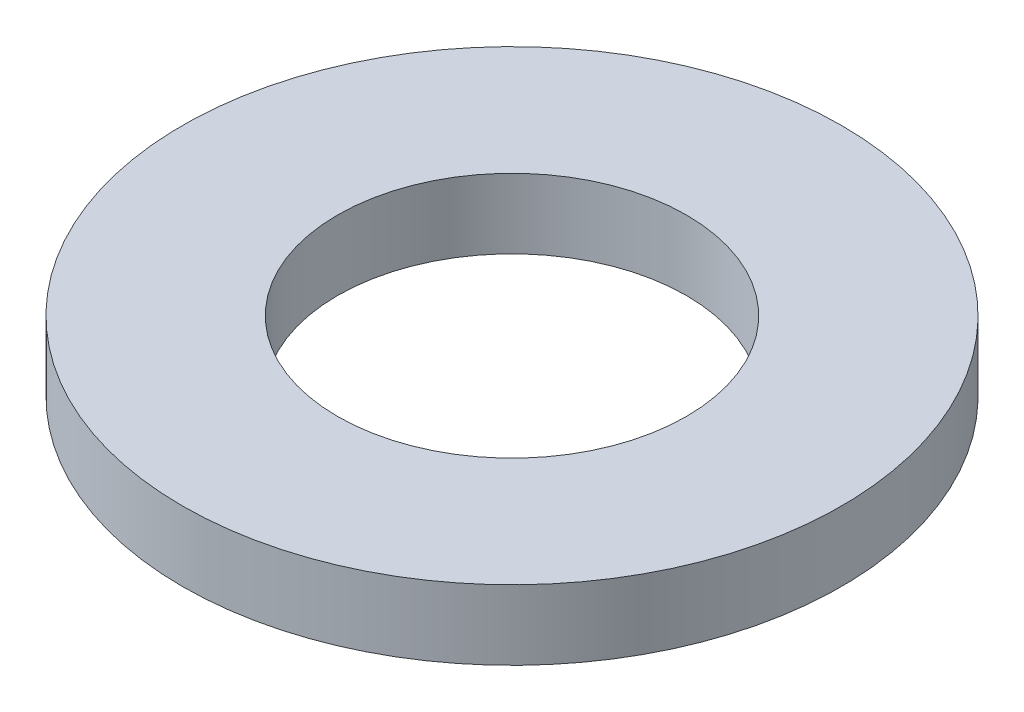
ISO-10303-21;
HEADER;
FILE_DESCRIPTION(('STEP AP214'),'2;1');
FILE_NAME('part.step','',(''),(''),'','','');
FILE_SCHEMA(('AUTOMOTIVE_DESIGN { 1 0 10303 214 1 1 1 1 }'));
ENDSEC;
DATA;
#1=APPLICATION_CONTEXT('core data for automotive mechanical design processes');
#2=APPLICATION_PROTOCOL_DEFINITION('international standard','automotive_design',2000,#1);
#3=PRODUCT_CONTEXT('',#1,'mechanical');
#4=PRODUCT('Part','Part','',(#3));
#5=PRODUCT_RELATED_PRODUCT_CATEGORY('part','',(#4));
#6=PRODUCT_DEFINITION_FORMATION('','',#4);
#7=PRODUCT_DEFINITION_CONTEXT('part definition',#1,'design');
#8=PRODUCT_DEFINITION('design','',#6,#7);
#9=PRODUCT_DEFINITION_SHAPE('','',#8);
#10=(LENGTH_UNIT() NAMED_UNIT(*) SI_UNIT(.MILLI.,.METRE.));
#11=(NAMED_UNIT(*) PLANE_ANGLE_UNIT() SI_UNIT($,.RADIAN.));
#12=(NAMED_UNIT(*) SI_UNIT($,.STERADIAN.) SOLID_ANGLE_UNIT());
#13=UNCERTAINTY_MEASURE_WITH_UNIT(LENGTH_MEASURE(1.E-05),#10,'distance_accuracy_value','');
#14=(GEOMETRIC_REPRESENTATION_CONTEXT(3) GLOBAL_UNCERTAINTY_ASSIGNED_CONTEXT((#13)) GLOBAL_UNIT_ASSIGNED_CONTEXT((#10,
#11,#12)) REPRESENTATION_CONTEXT('',''));
#15=CARTESIAN_POINT('',(0.,0.,0.));
#16=DIRECTION('',(0.,0.,1.));
#17=DIRECTION('',(1.,0.,0.));
#18=AXIS2_PLACEMENT_3D('',#15,#16,#17);
#19=CARTESIAN_POINT('',(0.,18.,0.));
#20=DIRECTION('',(0.,-1.,0.));
#21=DIRECTION('',(0.,0.,-1.));
#22=AXIS2_PLACEMENT_3D('',#19,#20,#21);
#23=CYLINDRICAL_SURFACE('',#22,85.);
#24=CARTESIAN_POINT('',(0.,18.,0.));
#25=DIRECTION('',(0.,1.,0.));
#26=DIRECTION('',(0.,0.,1.));
#27=AXIS2_PLACEMENT_3D('',#24,#25,#26);
#28=CIRCLE('',#27,85.);
#29=CARTESIAN_POINT('',(0.,18.,85.));
#30=VERTEX_POINT('',#29);
#31=EDGE_CURVE('E10',#30,#30,#28,.T.);
#32=ORIENTED_EDGE('',*,*,#31,.F.);
#33=EDGE_LOOP('',(#32));
#34=FACE_BOUND('',#33,.T.);
#35=CARTESIAN_POINT('',(0.,0.,0.));
#36=DIRECTION('',(0.,1.,0.));
#37=DIRECTION('',(0.,0.,1.));
#38=AXIS2_PLACEMENT_3D('',#35,#36,#37);
#39=CIRCLE('',#38,85.);
#40=CARTESIAN_POINT('',(0.,0.,85.));
#41=VERTEX_POINT('',#40);
#42=EDGE_CURVE('E37',#41,#41,#39,.T.);
#43=ORIENTED_EDGE('',*,*,#42,.T.);
#44=EDGE_LOOP('',(#43));
#45=FACE_BOUND('',#44,.T.);
#46=ADVANCED_FACE('F40',(#34,#45),#23,.T.);
#47=CARTESIAN_POINT('',(0.,18.,0.));
#48=DIRECTION('',(0.,1.,0.));
#49=DIRECTION('',(0.,0.,1.));
#50=AXIS2_PLACEMENT_3D('',#47,#48,#49);
#51=PLANE('',#50);
#52=CARTESIAN_POINT('',(0.,18.,0.));
#53=DIRECTION('',(0.,1.,0.));
#54=DIRECTION('',(0.,0.,1.));
#55=AXIS2_PLACEMENT_3D('',#52,#53,#54);
#56=CIRCLE('',#55,45.);
#57=CARTESIAN_POINT('',(0.,18.,45.));
#58=VERTEX_POINT('',#57);
#59=EDGE_CURVE('E50',#58,#58,#56,.T.);
#60=ORIENTED_EDGE('',*,*,#59,.F.);
#61=EDGE_LOOP('',(#60));
#62=FACE_BOUND('',#61,.T.);
#63=ORIENTED_EDGE('',*,*,#31,.T.);
#64=EDGE_LOOP('',(#63));
#65=FACE_BOUND('',#64,.T.);
#66=ADVANCED_FACE('F59',(#62,#65),#51,.T.);
#67=CARTESIAN_POINT('',(0.,0.,0.));
#68=DIRECTION('',(0.,1.,0.));
#69=DIRECTION('',(0.,0.,1.));
#70=AXIS2_PLACEMENT_3D('',#67,#68,#69);
#71=PLANE('',#70);
#72=CARTESIAN_POINT('',(0.,0.,0.));
#73=DIRECTION('',(0.,1.,0.));
#74=DIRECTION('',(0.,0.,1.));
#75=AXIS2_PLACEMENT_3D('',#72,#73,#74);
#76=CIRCLE('',#75,45.);
#77=CARTESIAN_POINT('',(0.,0.,45.));
#78=VERTEX_POINT('',#77);
#79=EDGE_CURVE('E47',#78,#78,#76,.T.);
#80=ORIENTED_EDGE('',*,*,#79,.T.);
#81=EDGE_LOOP('',(#80));
#82=FACE_BOUND('',#81,.T.);
#83=ORIENTED_EDGE('',*,*,#42,.F.);
#84=EDGE_LOOP('',(#83));
#85=FACE_BOUND('',#84,.T.);
#86=ADVANCED_FACE('F58',(#82,#85),#71,.F.);
#87=CARTESIAN_POINT('',(0.,18.,0.));
#88=DIRECTION('',(0.,-1.,0.));
#89=DIRECTION('',(0.,0.,-1.));
#90=AXIS2_PLACEMENT_3D('',#87,#88,#89);
#91=CYLINDRICAL_SURFACE('',#90,45.);
#92=ORIENTED_EDGE('',*,*,#59,.T.);
#93=EDGE_LOOP('',(#92));
#94=FACE_BOUND('',#93,.T.);
#95=ORIENTED_EDGE('',*,*,#79,.F.);
#96=EDGE_LOOP('',(#95));
#97=FACE_BOUND('',#96,.T.);
#98=ADVANCED_FACE('F54',(#94,#97),#91,.F.);
#99=CLOSED_SHELL('',(#46,#66,#86,#98));
#100=MANIFOLD_SOLID_BREP('B2',#99);
#101=ADVANCED_BREP_SHAPE_REPRESENTATION('',(#18,#100),#14);
#102=SHAPE_DEFINITION_REPRESENTATION(#9,#101);
ENDSEC;
END-ISO-10303-21;
